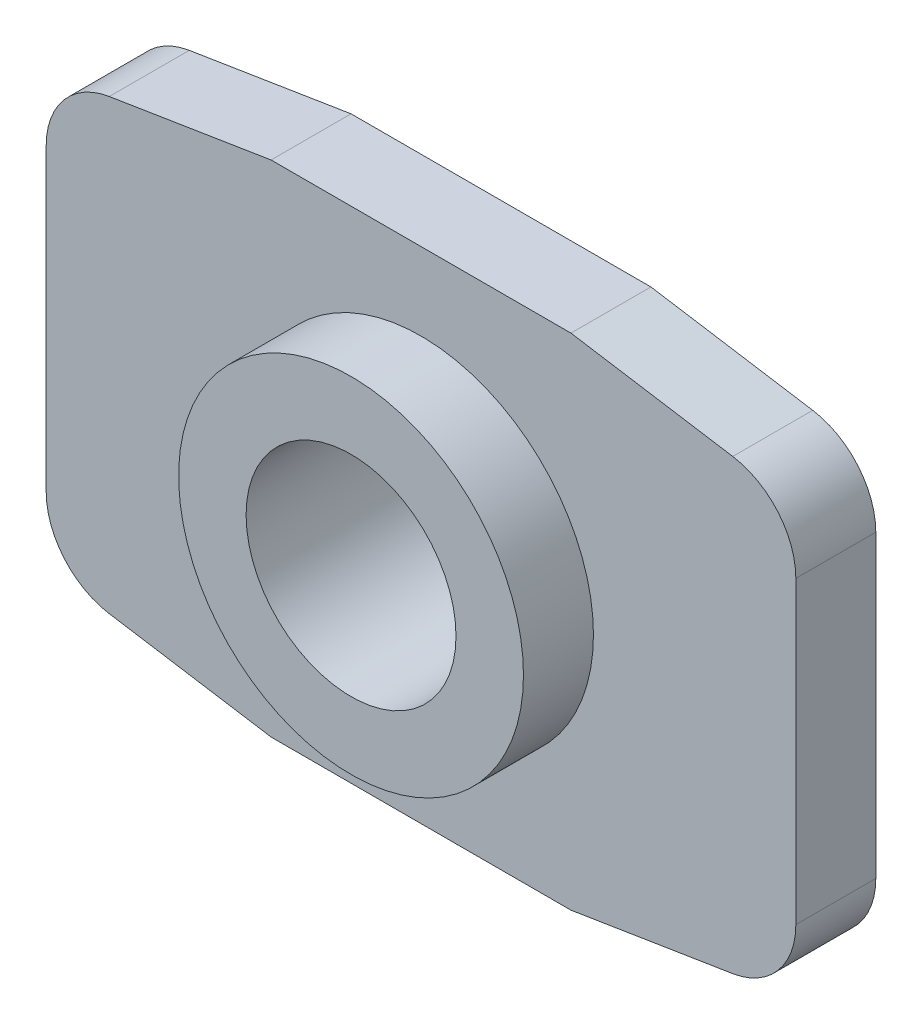
ISO-10303-21;
HEADER;
FILE_DESCRIPTION(('STEP AP214'),'2;1');
FILE_NAME('part.step','',(''),(''),'','','');
FILE_SCHEMA(('AUTOMOTIVE_DESIGN { 1 0 10303 214 1 1 1 1 }'));
ENDSEC;
DATA;
#1=APPLICATION_CONTEXT('core data for automotive mechanical design processes');
#2=APPLICATION_PROTOCOL_DEFINITION('international standard','automotive_design',2000,#1);
#3=PRODUCT_CONTEXT('',#1,'mechanical');
#4=PRODUCT('Part','Part','',(#3));
#5=PRODUCT_RELATED_PRODUCT_CATEGORY('part','',(#4));
#6=PRODUCT_DEFINITION_FORMATION('','',#4);
#7=PRODUCT_DEFINITION_CONTEXT('part definition',#1,'design');
#8=PRODUCT_DEFINITION('design','',#6,#7);
#9=PRODUCT_DEFINITION_SHAPE('','',#8);
#10=(LENGTH_UNIT() NAMED_UNIT(*) SI_UNIT(.MILLI.,.METRE.));
#11=(NAMED_UNIT(*) PLANE_ANGLE_UNIT() SI_UNIT($,.RADIAN.));
#12=(NAMED_UNIT(*) SI_UNIT($,.STERADIAN.) SOLID_ANGLE_UNIT());
#13=UNCERTAINTY_MEASURE_WITH_UNIT(LENGTH_MEASURE(1.E-05),#10,'distance_accuracy_value','');
#14=(GEOMETRIC_REPRESENTATION_CONTEXT(3) GLOBAL_UNCERTAINTY_ASSIGNED_CONTEXT((#13)) GLOBAL_UNIT_ASSIGNED_CONTEXT((#10,
#11,#12)) REPRESENTATION_CONTEXT('',''));
#15=CARTESIAN_POINT('',(0.,0.,0.));
#16=DIRECTION('',(0.,0.,1.));
#17=DIRECTION('',(1.,0.,0.));
#18=AXIS2_PLACEMENT_3D('',#15,#16,#17);
#19=CARTESIAN_POINT('',(6.,3.,1.6));
#20=DIRECTION('',(0.,0.,1.));
#21=DIRECTION('',(1.,0.,0.));
#22=AXIS2_PLACEMENT_3D('',#19,#20,#21);
#23=PLANE('',#22);
#24=CARTESIAN_POINT('',(6.,3.,1.6));
#25=DIRECTION('',(0.,0.,1.));
#26=DIRECTION('',(1.,0.,0.));
#27=AXIS2_PLACEMENT_3D('',#24,#25,#26);
#28=CIRCLE('',#27,1.5);
#29=CARTESIAN_POINT('',(7.5,3.,1.6));
#30=VERTEX_POINT('',#29);
#31=CARTESIAN_POINT('',(6.23739675280407,4.48109512920611,1.6));
#32=VERTEX_POINT('',#31);
#33=EDGE_CURVE('E200',#30,#32,#28,.T.);
#34=ORIENTED_EDGE('',*,*,#33,.T.);
#35=DIRECTION('',(-0.987396752804077,0.158264501869385,0.));
#36=VECTOR('',#35,1.);
#37=CARTESIAN_POINT('',(6.23739675280407,4.48109512920611,1.6));
#38=LINE('',#37,#36);
#39=CARTESIAN_POINT('',(3.,5.,1.6));
#40=VERTEX_POINT('',#39);
#41=EDGE_CURVE('E109',#32,#40,#38,.T.);
#42=ORIENTED_EDGE('',*,*,#41,.T.);
#43=DIRECTION('',(-1.,0.,0.));
#44=VECTOR('',#43,1.);
#45=CARTESIAN_POINT('',(-3.,5.,1.6));
#46=LINE('',#45,#44);
#47=CARTESIAN_POINT('',(-3.,5.,1.6));
#48=VERTEX_POINT('',#47);
#49=EDGE_CURVE('E237',#40,#48,#46,.T.);
#50=ORIENTED_EDGE('',*,*,#49,.T.);
#51=DIRECTION('',(-0.987396752804077,-0.158264501869386,0.));
#52=VECTOR('',#51,1.);
#53=CARTESIAN_POINT('',(-6.23739675280407,4.48109512920611,1.6));
#54=LINE('',#53,#52);
#55=CARTESIAN_POINT('',(-6.23739675280407,4.48109512920611,1.6));
#56=VERTEX_POINT('',#55);
#57=EDGE_CURVE('E256',#48,#56,#54,.T.);
#58=ORIENTED_EDGE('',*,*,#57,.T.);
#59=CARTESIAN_POINT('',(-6.,3.,1.6));
#60=DIRECTION('',(0.,0.,1.));
#61=DIRECTION('',(-1.,0.,0.));
#62=AXIS2_PLACEMENT_3D('',#59,#60,#61);
#63=CIRCLE('',#62,1.5);
#64=CARTESIAN_POINT('',(-7.5,3.,1.6));
#65=VERTEX_POINT('',#64);
#66=EDGE_CURVE('E252',#56,#65,#63,.T.);
#67=ORIENTED_EDGE('',*,*,#66,.T.);
#68=DIRECTION('',(0.,-1.,0.));
#69=VECTOR('',#68,1.);
#70=CARTESIAN_POINT('',(-7.5,-3.,1.6));
#71=LINE('',#70,#69);
#72=CARTESIAN_POINT('',(-7.5,-3.,1.6));
#73=VERTEX_POINT('',#72);
#74=EDGE_CURVE('E255',#65,#73,#71,.T.);
#75=ORIENTED_EDGE('',*,*,#74,.T.);
#76=CARTESIAN_POINT('',(-6.,-3.,1.6));
#77=DIRECTION('',(0.,0.,1.));
#78=DIRECTION('',(1.,0.,0.));
#79=AXIS2_PLACEMENT_3D('',#76,#77,#78);
#80=CIRCLE('',#79,1.5);
#81=CARTESIAN_POINT('',(-6.23739675280407,-4.48109512920612,1.6));
#82=VERTEX_POINT('',#81);
#83=EDGE_CURVE('E261',#73,#82,#80,.T.);
#84=ORIENTED_EDGE('',*,*,#83,.T.);
#85=DIRECTION('',(0.987396752804077,-0.158264501869385,0.));
#86=VECTOR('',#85,1.);
#87=CARTESIAN_POINT('',(-6.23739675280407,-4.48109512920612,1.6));
#88=LINE('',#87,#86);
#89=CARTESIAN_POINT('',(-3.,-5.,1.6));
#90=VERTEX_POINT('',#89);
#91=EDGE_CURVE('E269',#82,#90,#88,.T.);
#92=ORIENTED_EDGE('',*,*,#91,.T.);
#93=DIRECTION('',(1.,0.,0.));
#94=VECTOR('',#93,1.);
#95=CARTESIAN_POINT('',(-3.,-5.,1.6));
#96=LINE('',#95,#94);
#97=CARTESIAN_POINT('',(3.,-5.,1.6));
#98=VERTEX_POINT('',#97);
#99=EDGE_CURVE('E140',#90,#98,#96,.T.);
#100=ORIENTED_EDGE('',*,*,#99,.T.);
#101=DIRECTION('',(0.987396752804077,0.158264501869385,0.));
#102=VECTOR('',#101,1.);
#103=CARTESIAN_POINT('',(6.23739675280407,-4.48109512920611,1.6));
#104=LINE('',#103,#102);
#105=CARTESIAN_POINT('',(6.23739675280407,-4.48109512920612,1.6));
#106=VERTEX_POINT('',#105);
#107=EDGE_CURVE('E134',#98,#106,#104,.T.);
#108=ORIENTED_EDGE('',*,*,#107,.T.);
#109=CARTESIAN_POINT('',(6.,-3.,1.6));
#110=DIRECTION('',(0.,0.,1.));
#111=DIRECTION('',(-1.,0.,0.));
#112=AXIS2_PLACEMENT_3D('',#109,#110,#111);
#113=CIRCLE('',#112,1.5);
#114=CARTESIAN_POINT('',(7.5,-3.,1.6));
#115=VERTEX_POINT('',#114);
#116=EDGE_CURVE('E138',#106,#115,#113,.T.);
#117=ORIENTED_EDGE('',*,*,#116,.T.);
#118=DIRECTION('',(0.,1.,0.));
#119=VECTOR('',#118,1.);
#120=CARTESIAN_POINT('',(7.5,-3.,1.6));
#121=LINE('',#120,#119);
#122=EDGE_CURVE('E54',#115,#30,#121,.T.);
#123=ORIENTED_EDGE('',*,*,#122,.T.);
#124=EDGE_LOOP('',(#34,#42,#50,#58,#67,#75,#84,#92,#100,#108,#117,#123));
#125=FACE_BOUND('',#124,.T.);
#126=CARTESIAN_POINT('',(0.,0.,1.6));
#127=DIRECTION('',(0.,0.,1.));
#128=DIRECTION('',(1.,0.,0.));
#129=AXIS2_PLACEMENT_3D('',#126,#127,#128);
#130=CIRCLE('',#129,3.45);
#131=CARTESIAN_POINT('',(3.45,0.,1.6));
#132=VERTEX_POINT('',#131);
#133=EDGE_CURVE('E279',#132,#132,#130,.T.);
#134=ORIENTED_EDGE('',*,*,#133,.F.);
#135=EDGE_LOOP('',(#134));
#136=FACE_BOUND('',#135,.T.);
#137=ADVANCED_FACE('F36',(#125,#136),#23,.T.);
#138=CARTESIAN_POINT('',(6.,3.,1.6));
#139=DIRECTION('',(0.,0.,-1.));
#140=DIRECTION('',(-1.,0.,0.));
#141=AXIS2_PLACEMENT_3D('',#138,#139,#140);
#142=CYLINDRICAL_SURFACE('',#141,1.5);
#143=CARTESIAN_POINT('',(6.,3.,0.));
#144=DIRECTION('',(0.,0.,1.));
#145=DIRECTION('',(1.,0.,0.));
#146=AXIS2_PLACEMENT_3D('',#143,#144,#145);
#147=CIRCLE('',#146,1.5);
#148=CARTESIAN_POINT('',(7.5,3.,0.));
#149=VERTEX_POINT('',#148);
#150=CARTESIAN_POINT('',(6.23739675280407,4.48109512920611,0.));
#151=VERTEX_POINT('',#150);
#152=EDGE_CURVE('E165',#149,#151,#147,.T.);
#153=ORIENTED_EDGE('',*,*,#152,.T.);
#154=DIRECTION('',(0.,0.,-1.));
#155=VECTOR('',#154,1.);
#156=CARTESIAN_POINT('',(6.23739675280407,4.48109512920611,1.6));
#157=LINE('',#156,#155);
#158=EDGE_CURVE('E11',#32,#151,#157,.T.);
#159=ORIENTED_EDGE('',*,*,#158,.F.);
#160=ORIENTED_EDGE('',*,*,#33,.F.);
#161=DIRECTION('',(0.,0.,-1.));
#162=VECTOR('',#161,1.);
#163=CARTESIAN_POINT('',(7.5,3.,1.6));
#164=LINE('',#163,#162);
#165=EDGE_CURVE('E161',#30,#149,#164,.T.);
#166=ORIENTED_EDGE('',*,*,#165,.T.);
#167=EDGE_LOOP('',(#153,#159,#160,#166));
#168=FACE_BOUND('',#167,.T.);
#169=ADVANCED_FACE('F38',(#168),#142,.T.);
#170=CARTESIAN_POINT('',(6.23739675280407,4.48109512920611,1.6));
#171=DIRECTION('',(-0.158264501869385,-0.987396752804077,0.));
#172=DIRECTION('',(0.987396752804077,-0.158264501869385,0.));
#173=AXIS2_PLACEMENT_3D('',#170,#171,#172);
#174=PLANE('',#173);
#175=DIRECTION('',(-0.987396752804077,0.158264501869385,0.));
#176=VECTOR('',#175,1.);
#177=CARTESIAN_POINT('',(6.23739675280407,4.48109512920611,0.));
#178=LINE('',#177,#176);
#179=CARTESIAN_POINT('',(3.,5.,0.));
#180=VERTEX_POINT('',#179);
#181=EDGE_CURVE('E169',#151,#180,#178,.T.);
#182=ORIENTED_EDGE('',*,*,#181,.T.);
#183=DIRECTION('',(0.,0.,-1.));
#184=VECTOR('',#183,1.);
#185=CARTESIAN_POINT('',(3.,5.,1.6));
#186=LINE('',#185,#184);
#187=EDGE_CURVE('E46',#40,#180,#186,.T.);
#188=ORIENTED_EDGE('',*,*,#187,.F.);
#189=ORIENTED_EDGE('',*,*,#41,.F.);
#190=ORIENTED_EDGE('',*,*,#158,.T.);
#191=EDGE_LOOP('',(#182,#188,#189,#190));
#192=FACE_BOUND('',#191,.T.);
#193=ADVANCED_FACE('F308',(#192),#174,.F.);
#194=CARTESIAN_POINT('',(-3.,5.,1.6));
#195=DIRECTION('',(0.,-1.,0.));
#196=DIRECTION('',(0.,0.,-1.));
#197=AXIS2_PLACEMENT_3D('',#194,#195,#196);
#198=PLANE('',#197);
#199=DIRECTION('',(-1.,0.,0.));
#200=VECTOR('',#199,1.);
#201=CARTESIAN_POINT('',(-3.,5.,0.));
#202=LINE('',#201,#200);
#203=CARTESIAN_POINT('',(-3.,5.,0.));
#204=VERTEX_POINT('',#203);
#205=EDGE_CURVE('E173',#180,#204,#202,.T.);
#206=ORIENTED_EDGE('',*,*,#205,.T.);
#207=DIRECTION('',(0.,0.,-1.));
#208=VECTOR('',#207,1.);
#209=CARTESIAN_POINT('',(-3.,5.,1.6));
#210=LINE('',#209,#208);
#211=EDGE_CURVE('E226',#48,#204,#210,.T.);
#212=ORIENTED_EDGE('',*,*,#211,.F.);
#213=ORIENTED_EDGE('',*,*,#49,.F.);
#214=ORIENTED_EDGE('',*,*,#187,.T.);
#215=EDGE_LOOP('',(#206,#212,#213,#214));
#216=FACE_BOUND('',#215,.T.);
#217=ADVANCED_FACE('F235',(#216),#198,.F.);
#218=CARTESIAN_POINT('',(-6.23739675280407,4.48109512920611,1.6));
#219=DIRECTION('',(0.158264501869386,-0.987396752804077,0.));
#220=DIRECTION('',(0.987396752804077,0.158264501869386,0.));
#221=AXIS2_PLACEMENT_3D('',#218,#219,#220);
#222=PLANE('',#221);
#223=DIRECTION('',(-0.987396752804077,-0.158264501869386,0.));
#224=VECTOR('',#223,1.);
#225=CARTESIAN_POINT('',(-6.23739675280407,4.48109512920611,0.));
#226=LINE('',#225,#224);
#227=CARTESIAN_POINT('',(-6.23739675280407,4.48109512920611,0.));
#228=VERTEX_POINT('',#227);
#229=EDGE_CURVE('E176',#204,#228,#226,.T.);
#230=ORIENTED_EDGE('',*,*,#229,.T.);
#231=DIRECTION('',(0.,0.,-1.));
#232=VECTOR('',#231,1.);
#233=CARTESIAN_POINT('',(-6.23739675280407,4.48109512920611,1.6));
#234=LINE('',#233,#232);
#235=EDGE_CURVE('E222',#56,#228,#234,.T.);
#236=ORIENTED_EDGE('',*,*,#235,.F.);
#237=ORIENTED_EDGE('',*,*,#57,.F.);
#238=ORIENTED_EDGE('',*,*,#211,.T.);
#239=EDGE_LOOP('',(#230,#236,#237,#238));
#240=FACE_BOUND('',#239,.T.);
#241=ADVANCED_FACE('F246',(#240),#222,.F.);
#242=CARTESIAN_POINT('',(-6.,3.,1.6));
#243=DIRECTION('',(0.,0.,-1.));
#244=DIRECTION('',(-1.,0.,0.));
#245=AXIS2_PLACEMENT_3D('',#242,#243,#244);
#246=CYLINDRICAL_SURFACE('',#245,1.5);
#247=CARTESIAN_POINT('',(-6.,3.,0.));
#248=DIRECTION('',(0.,0.,1.));
#249=DIRECTION('',(-1.,0.,0.));
#250=AXIS2_PLACEMENT_3D('',#247,#248,#249);
#251=CIRCLE('',#250,1.5);
#252=CARTESIAN_POINT('',(-7.5,3.,0.));
#253=VERTEX_POINT('',#252);
#254=EDGE_CURVE('E179',#228,#253,#251,.T.);
#255=ORIENTED_EDGE('',*,*,#254,.T.);
#256=DIRECTION('',(0.,0.,-1.));
#257=VECTOR('',#256,1.);
#258=CARTESIAN_POINT('',(-7.5,3.,1.6));
#259=LINE('',#258,#257);
#260=EDGE_CURVE('E218',#65,#253,#259,.T.);
#261=ORIENTED_EDGE('',*,*,#260,.F.);
#262=ORIENTED_EDGE('',*,*,#66,.F.);
#263=ORIENTED_EDGE('',*,*,#235,.T.);
#264=EDGE_LOOP('',(#255,#261,#262,#263));
#265=FACE_BOUND('',#264,.T.);
#266=ADVANCED_FACE('F250',(#265),#246,.T.);
#267=CARTESIAN_POINT('',(-7.5,-3.,1.6));
#268=DIRECTION('',(1.,0.,0.));
#269=DIRECTION('',(0.,0.,-1.));
#270=AXIS2_PLACEMENT_3D('',#267,#268,#269);
#271=PLANE('',#270);
#272=DIRECTION('',(0.,-1.,0.));
#273=VECTOR('',#272,1.);
#274=CARTESIAN_POINT('',(-7.5,-3.,0.));
#275=LINE('',#274,#273);
#276=CARTESIAN_POINT('',(-7.5,-3.,0.));
#277=VERTEX_POINT('',#276);
#278=EDGE_CURVE('E182',#253,#277,#275,.T.);
#279=ORIENTED_EDGE('',*,*,#278,.T.);
#280=DIRECTION('',(0.,0.,-1.));
#281=VECTOR('',#280,1.);
#282=CARTESIAN_POINT('',(-7.5,-3.,1.6));
#283=LINE('',#282,#281);
#284=EDGE_CURVE('E215',#73,#277,#283,.T.);
#285=ORIENTED_EDGE('',*,*,#284,.F.);
#286=ORIENTED_EDGE('',*,*,#74,.F.);
#287=ORIENTED_EDGE('',*,*,#260,.T.);
#288=EDGE_LOOP('',(#279,#285,#286,#287));
#289=FACE_BOUND('',#288,.T.);
#290=ADVANCED_FACE('F344',(#289),#271,.F.);
#291=CARTESIAN_POINT('',(-6.,-3.,1.6));
#292=DIRECTION('',(0.,0.,-1.));
#293=DIRECTION('',(-1.,0.,0.));
#294=AXIS2_PLACEMENT_3D('',#291,#292,#293);
#295=CYLINDRICAL_SURFACE('',#294,1.5);
#296=CARTESIAN_POINT('',(-6.,-3.,0.));
#297=DIRECTION('',(0.,0.,1.));
#298=DIRECTION('',(1.,0.,0.));
#299=AXIS2_PLACEMENT_3D('',#296,#297,#298);
#300=CIRCLE('',#299,1.5);
#301=CARTESIAN_POINT('',(-6.23739675280407,-4.48109512920612,0.));
#302=VERTEX_POINT('',#301);
#303=EDGE_CURVE('E185',#277,#302,#300,.T.);
#304=ORIENTED_EDGE('',*,*,#303,.T.);
#305=DIRECTION('',(0.,0.,-1.));
#306=VECTOR('',#305,1.);
#307=CARTESIAN_POINT('',(-6.23739675280407,-4.48109512920612,1.6));
#308=LINE('',#307,#306);
#309=EDGE_CURVE('E211',#82,#302,#308,.T.);
#310=ORIENTED_EDGE('',*,*,#309,.F.);
#311=ORIENTED_EDGE('',*,*,#83,.F.);
#312=ORIENTED_EDGE('',*,*,#284,.T.);
#313=EDGE_LOOP('',(#304,#310,#311,#312));
#314=FACE_BOUND('',#313,.T.);
#315=ADVANCED_FACE('F340',(#314),#295,.T.);
#316=CARTESIAN_POINT('',(-6.23739675280407,-4.48109512920612,1.6));
#317=DIRECTION('',(0.158264501869385,0.987396752804077,0.));
#318=DIRECTION('',(-0.987396752804077,0.158264501869385,0.));
#319=AXIS2_PLACEMENT_3D('',#316,#317,#318);
#320=PLANE('',#319);
#321=DIRECTION('',(0.987396752804077,-0.158264501869385,0.));
#322=VECTOR('',#321,1.);
#323=CARTESIAN_POINT('',(-6.23739675280407,-4.48109512920612,0.));
#324=LINE('',#323,#322);
#325=CARTESIAN_POINT('',(-3.,-5.,0.));
#326=VERTEX_POINT('',#325);
#327=EDGE_CURVE('E188',#302,#326,#324,.T.);
#328=ORIENTED_EDGE('',*,*,#327,.T.);
#329=DIRECTION('',(0.,0.,-1.));
#330=VECTOR('',#329,1.);
#331=CARTESIAN_POINT('',(-3.,-5.,1.6));
#332=LINE('',#331,#330);
#333=EDGE_CURVE('E207',#90,#326,#332,.T.);
#334=ORIENTED_EDGE('',*,*,#333,.F.);
#335=ORIENTED_EDGE('',*,*,#91,.F.);
#336=ORIENTED_EDGE('',*,*,#309,.T.);
#337=EDGE_LOOP('',(#328,#334,#335,#336));
#338=FACE_BOUND('',#337,.T.);
#339=ADVANCED_FACE('F336',(#338),#320,.F.);
#340=CARTESIAN_POINT('',(-3.,-5.,1.6));
#341=DIRECTION('',(0.,1.,0.));
#342=DIRECTION('',(0.,0.,1.));
#343=AXIS2_PLACEMENT_3D('',#340,#341,#342);
#344=PLANE('',#343);
#345=DIRECTION('',(1.,0.,0.));
#346=VECTOR('',#345,1.);
#347=CARTESIAN_POINT('',(-3.,-5.,0.));
#348=LINE('',#347,#346);
#349=CARTESIAN_POINT('',(3.,-5.,0.));
#350=VERTEX_POINT('',#349);
#351=EDGE_CURVE('E191',#326,#350,#348,.T.);
#352=ORIENTED_EDGE('',*,*,#351,.T.);
#353=DIRECTION('',(0.,0.,-1.));
#354=VECTOR('',#353,1.);
#355=CARTESIAN_POINT('',(3.,-5.,1.6));
#356=LINE('',#355,#354);
#357=EDGE_CURVE('E151',#98,#350,#356,.T.);
#358=ORIENTED_EDGE('',*,*,#357,.F.);
#359=ORIENTED_EDGE('',*,*,#99,.F.);
#360=ORIENTED_EDGE('',*,*,#333,.T.);
#361=EDGE_LOOP('',(#352,#358,#359,#360));
#362=FACE_BOUND('',#361,.T.);
#363=ADVANCED_FACE('F333',(#362),#344,.F.);
#364=CARTESIAN_POINT('',(6.23739675280407,-4.48109512920611,1.6));
#365=DIRECTION('',(-0.158264501869385,0.987396752804077,0.));
#366=DIRECTION('',(-0.987396752804077,-0.158264501869385,0.));
#367=AXIS2_PLACEMENT_3D('',#364,#365,#366);
#368=PLANE('',#367);
#369=DIRECTION('',(0.987396752804077,0.158264501869385,0.));
#370=VECTOR('',#369,1.);
#371=CARTESIAN_POINT('',(6.23739675280407,-4.48109512920611,0.));
#372=LINE('',#371,#370);
#373=CARTESIAN_POINT('',(6.23739675280407,-4.48109512920612,0.));
#374=VERTEX_POINT('',#373);
#375=EDGE_CURVE('E149',#350,#374,#372,.T.);
#376=ORIENTED_EDGE('',*,*,#375,.T.);
#377=DIRECTION('',(0.,0.,-1.));
#378=VECTOR('',#377,1.);
#379=CARTESIAN_POINT('',(6.23739675280407,-4.48109512920612,1.6));
#380=LINE('',#379,#378);
#381=EDGE_CURVE('E146',#106,#374,#380,.T.);
#382=ORIENTED_EDGE('',*,*,#381,.F.);
#383=ORIENTED_EDGE('',*,*,#107,.F.);
#384=ORIENTED_EDGE('',*,*,#357,.T.);
#385=EDGE_LOOP('',(#376,#382,#383,#384));
#386=FACE_BOUND('',#385,.T.);
#387=ADVANCED_FACE('F147',(#386),#368,.F.);
#388=CARTESIAN_POINT('',(6.,-3.,1.6));
#389=DIRECTION('',(0.,0.,-1.));
#390=DIRECTION('',(-1.,0.,0.));
#391=AXIS2_PLACEMENT_3D('',#388,#389,#390);
#392=CYLINDRICAL_SURFACE('',#391,1.5);
#393=CARTESIAN_POINT('',(6.,-3.,0.));
#394=DIRECTION('',(0.,0.,1.));
#395=DIRECTION('',(-1.,0.,0.));
#396=AXIS2_PLACEMENT_3D('',#393,#394,#395);
#397=CIRCLE('',#396,1.5);
#398=CARTESIAN_POINT('',(7.5,-3.,0.));
#399=VERTEX_POINT('',#398);
#400=EDGE_CURVE('E95',#374,#399,#397,.T.);
#401=ORIENTED_EDGE('',*,*,#400,.T.);
#402=DIRECTION('',(0.,0.,-1.));
#403=VECTOR('',#402,1.);
#404=CARTESIAN_POINT('',(7.5,-3.,1.6));
#405=LINE('',#404,#403);
#406=EDGE_CURVE('E152',#115,#399,#405,.T.);
#407=ORIENTED_EDGE('',*,*,#406,.F.);
#408=ORIENTED_EDGE('',*,*,#116,.F.);
#409=ORIENTED_EDGE('',*,*,#381,.T.);
#410=EDGE_LOOP('',(#401,#407,#408,#409));
#411=FACE_BOUND('',#410,.T.);
#412=ADVANCED_FACE('F154',(#411),#392,.T.);
#413=CARTESIAN_POINT('',(7.5,-3.,1.6));
#414=DIRECTION('',(-1.,0.,0.));
#415=DIRECTION('',(0.,-1.,0.));
#416=AXIS2_PLACEMENT_3D('',#413,#414,#415);
#417=PLANE('',#416);
#418=DIRECTION('',(0.,1.,0.));
#419=VECTOR('',#418,1.);
#420=CARTESIAN_POINT('',(7.5,-3.,0.));
#421=LINE('',#420,#419);
#422=EDGE_CURVE('E101',#399,#149,#421,.T.);
#423=ORIENTED_EDGE('',*,*,#422,.T.);
#424=ORIENTED_EDGE('',*,*,#165,.F.);
#425=ORIENTED_EDGE('',*,*,#122,.F.);
#426=ORIENTED_EDGE('',*,*,#406,.T.);
#427=EDGE_LOOP('',(#423,#424,#425,#426));
#428=FACE_BOUND('',#427,.T.);
#429=ADVANCED_FACE('F325',(#428),#417,.F.);
#430=CARTESIAN_POINT('',(6.,3.,0.));
#431=DIRECTION('',(0.,0.,1.));
#432=DIRECTION('',(1.,0.,0.));
#433=AXIS2_PLACEMENT_3D('',#430,#431,#432);
#434=PLANE('',#433);
#435=CARTESIAN_POINT('',(0.,0.,0.));
#436=DIRECTION('',(0.,0.,1.));
#437=DIRECTION('',(1.,0.,0.));
#438=AXIS2_PLACEMENT_3D('',#435,#436,#437);
#439=CIRCLE('',#438,2.1);
#440=CARTESIAN_POINT('',(2.1,0.,0.));
#441=VERTEX_POINT('',#440);
#442=EDGE_CURVE('E276',#441,#441,#439,.T.);
#443=ORIENTED_EDGE('',*,*,#442,.T.);
#444=EDGE_LOOP('',(#443));
#445=FACE_BOUND('',#444,.T.);
#446=ORIENTED_EDGE('',*,*,#152,.F.);
#447=ORIENTED_EDGE('',*,*,#422,.F.);
#448=ORIENTED_EDGE('',*,*,#400,.F.);
#449=ORIENTED_EDGE('',*,*,#375,.F.);
#450=ORIENTED_EDGE('',*,*,#351,.F.);
#451=ORIENTED_EDGE('',*,*,#327,.F.);
#452=ORIENTED_EDGE('',*,*,#303,.F.);
#453=ORIENTED_EDGE('',*,*,#278,.F.);
#454=ORIENTED_EDGE('',*,*,#254,.F.);
#455=ORIENTED_EDGE('',*,*,#229,.F.);
#456=ORIENTED_EDGE('',*,*,#205,.F.);
#457=ORIENTED_EDGE('',*,*,#181,.F.);
#458=EDGE_LOOP('',(#446,#447,#448,#449,#450,#451,#452,#453,#454,#455,#456,#457));
#459=FACE_BOUND('',#458,.T.);
#460=ADVANCED_FACE('F241',(#445,#459),#434,.F.);
#461=CARTESIAN_POINT('',(0.,0.,3.));
#462=DIRECTION('',(0.,0.,-1.));
#463=DIRECTION('',(-1.,0.,0.));
#464=AXIS2_PLACEMENT_3D('',#461,#462,#463);
#465=CYLINDRICAL_SURFACE('',#464,3.45);
#466=CARTESIAN_POINT('',(0.,0.,3.));
#467=DIRECTION('',(0.,0.,1.));
#468=DIRECTION('',(1.,0.,0.));
#469=AXIS2_PLACEMENT_3D('',#466,#467,#468);
#470=CIRCLE('',#469,3.45);
#471=CARTESIAN_POINT('',(3.45,0.,3.));
#472=VERTEX_POINT('',#471);
#473=EDGE_CURVE('E170',#472,#472,#470,.T.);
#474=ORIENTED_EDGE('',*,*,#473,.F.);
#475=EDGE_LOOP('',(#474));
#476=FACE_BOUND('',#475,.T.);
#477=ORIENTED_EDGE('',*,*,#133,.T.);
#478=EDGE_LOOP('',(#477));
#479=FACE_BOUND('',#478,.T.);
#480=ADVANCED_FACE('F321',(#476,#479),#465,.T.);
#481=CARTESIAN_POINT('',(0.,0.,3.));
#482=DIRECTION('',(0.,0.,1.));
#483=DIRECTION('',(1.,0.,0.));
#484=AXIS2_PLACEMENT_3D('',#481,#482,#483);
#485=PLANE('',#484);
#486=CARTESIAN_POINT('',(0.,0.,3.));
#487=DIRECTION('',(0.,0.,1.));
#488=DIRECTION('',(1.,0.,0.));
#489=AXIS2_PLACEMENT_3D('',#486,#487,#488);
#490=CIRCLE('',#489,2.09999999999999);
#491=CARTESIAN_POINT('',(2.09999999999999,0.,3.));
#492=VERTEX_POINT('',#491);
#493=EDGE_CURVE('E280',#492,#492,#490,.T.);
#494=ORIENTED_EDGE('',*,*,#493,.F.);
#495=EDGE_LOOP('',(#494));
#496=FACE_BOUND('',#495,.T.);
#497=ORIENTED_EDGE('',*,*,#473,.T.);
#498=EDGE_LOOP('',(#497));
#499=FACE_BOUND('',#498,.T.);
#500=ADVANCED_FACE('F401',(#496,#499),#485,.T.);
#501=CARTESIAN_POINT('',(0.,0.,3.));
#502=DIRECTION('',(0.,0.,1.));
#503=DIRECTION('',(1.,0.,0.));
#504=AXIS2_PLACEMENT_3D('',#501,#502,#503);
#505=CYLINDRICAL_SURFACE('',#504,2.09999999999999);
#506=ORIENTED_EDGE('',*,*,#442,.F.);
#507=EDGE_LOOP('',(#506));
#508=FACE_BOUND('',#507,.T.);
#509=ORIENTED_EDGE('',*,*,#493,.T.);
#510=EDGE_LOOP('',(#509));
#511=FACE_BOUND('',#510,.T.);
#512=ADVANCED_FACE('F407',(#508,#511),#505,.F.);
#513=CLOSED_SHELL('',(#137,#169,#193,#217,#241,#266,#290,#315,#339,#363,#387,#412,#429,#460,
#480,#500,#512));
#514=MANIFOLD_SOLID_BREP('B2',#513);
#515=ADVANCED_BREP_SHAPE_REPRESENTATION('',(#18,#514),#14);
#516=SHAPE_DEFINITION_REPRESENTATION(#9,#515);
ENDSEC;
END-ISO-10303-21;
